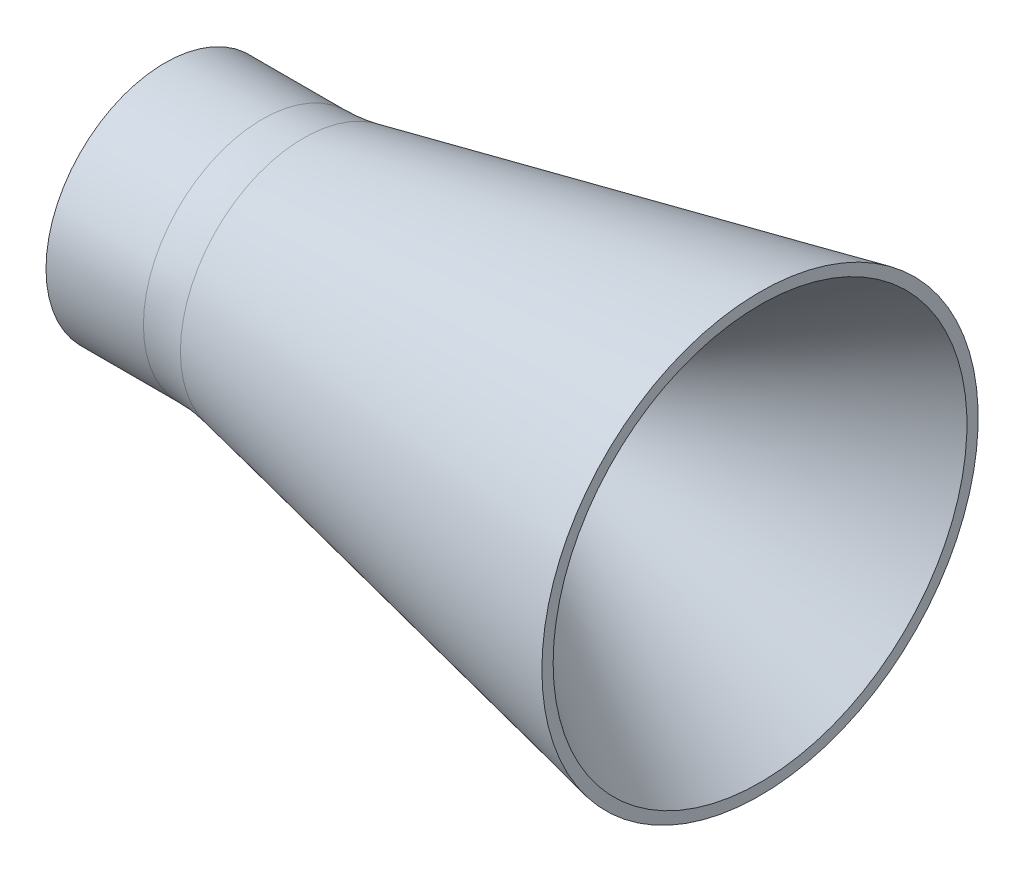
ISO-10303-21;
HEADER;
FILE_DESCRIPTION(('STEP AP214'),'2;1');
FILE_NAME('part.step','',(''),(''),'','','');
FILE_SCHEMA(('AUTOMOTIVE_DESIGN { 1 0 10303 214 1 1 1 1 }'));
ENDSEC;
DATA;
#1=APPLICATION_CONTEXT('core data for automotive mechanical design processes');
#2=APPLICATION_PROTOCOL_DEFINITION('international standard','automotive_design',2000,#1);
#3=PRODUCT_CONTEXT('',#1,'mechanical');
#4=PRODUCT('Part','Part','',(#3));
#5=PRODUCT_RELATED_PRODUCT_CATEGORY('part','',(#4));
#6=PRODUCT_DEFINITION_FORMATION('','',#4);
#7=PRODUCT_DEFINITION_CONTEXT('part definition',#1,'design');
#8=PRODUCT_DEFINITION('design','',#6,#7);
#9=PRODUCT_DEFINITION_SHAPE('','',#8);
#10=(LENGTH_UNIT() NAMED_UNIT(*) SI_UNIT(.MILLI.,.METRE.));
#11=(NAMED_UNIT(*) PLANE_ANGLE_UNIT() SI_UNIT($,.RADIAN.));
#12=(NAMED_UNIT(*) SI_UNIT($,.STERADIAN.) SOLID_ANGLE_UNIT());
#13=UNCERTAINTY_MEASURE_WITH_UNIT(LENGTH_MEASURE(1.E-05),#10,'distance_accuracy_value','');
#14=(GEOMETRIC_REPRESENTATION_CONTEXT(3) GLOBAL_UNCERTAINTY_ASSIGNED_CONTEXT((#13)) GLOBAL_UNIT_ASSIGNED_CONTEXT((#10,
#11,#12)) REPRESENTATION_CONTEXT('',''));
#15=CARTESIAN_POINT('',(0.,0.,0.));
#16=DIRECTION('',(0.,0.,1.));
#17=DIRECTION('',(1.,0.,0.));
#18=AXIS2_PLACEMENT_3D('',#15,#16,#17);
#19=CARTESIAN_POINT('',(110.081050811535,-13.5925231782912,0.));
#20=DIRECTION('',(-1.,0.,0.));
#21=DIRECTION('',(0.,0.,1.));
#22=AXIS2_PLACEMENT_3D('',#19,#20,#21);
#23=TOROIDAL_SURFACE('',#22,60.,40.);
#24=CARTESIAN_POINT('',(110.081050811535,-13.5925231782912,0.));
#25=DIRECTION('',(-1.,0.,0.));
#26=DIRECTION('',(0.,0.,1.));
#27=AXIS2_PLACEMENT_3D('',#24,#25,#26);
#28=CIRCLE('',#27,20.);
#29=CARTESIAN_POINT('',(110.081050811535,-13.5925231782912,20.));
#30=VERTEX_POINT('',#29);
#31=EDGE_CURVE('E10',#30,#30,#28,.T.);
#32=ORIENTED_EDGE('',*,*,#31,.F.);
#33=EDGE_LOOP('',(#32));
#34=FACE_BOUND('',#33,.T.);
#35=CARTESIAN_POINT('',(95.7463328297226,-13.5925231782912,0.));
#36=DIRECTION('',(-1.,0.,0.));
#37=DIRECTION('',(0.,0.,1.));
#38=AXIS2_PLACEMENT_3D('',#35,#36,#37);
#39=CIRCLE('',#38,22.6567829401119);
#40=CARTESIAN_POINT('',(95.7463328297226,-13.5925231782912,22.6567829401119));
#41=VERTEX_POINT('',#40);
#42=EDGE_CURVE('E73',#41,#41,#39,.T.);
#43=ORIENTED_EDGE('',*,*,#42,.T.);
#44=EDGE_LOOP('',(#43));
#45=FACE_BOUND('',#44,.T.);
#46=ADVANCED_FACE('F33',(#34,#45),#23,.T.);
#47=CARTESIAN_POINT('',(-9.07901843118839,-13.5925231782912,0.));
#48=DIRECTION('',(-1.,0.,0.));
#49=DIRECTION('',(0.,0.,1.));
#50=AXIS2_PLACEMENT_3D('',#47,#48,#49);
#51=CYLINDRICAL_SURFACE('',#50,20.);
#52=CARTESIAN_POINT('',(127.851823553188,-13.5925231782912,0.));
#53=DIRECTION('',(-1.,0.,0.));
#54=DIRECTION('',(0.,0.,1.));
#55=AXIS2_PLACEMENT_3D('',#52,#53,#54);
#56=CIRCLE('',#55,20.);
#57=CARTESIAN_POINT('',(127.851823553188,-13.5925231782912,20.));
#58=VERTEX_POINT('',#57);
#59=EDGE_CURVE('E39',#58,#58,#56,.T.);
#60=ORIENTED_EDGE('',*,*,#59,.F.);
#61=EDGE_LOOP('',(#60));
#62=FACE_BOUND('',#61,.T.);
#63=ORIENTED_EDGE('',*,*,#31,.T.);
#64=EDGE_LOOP('',(#63));
#65=FACE_BOUND('',#64,.T.);
#66=ADVANCED_FACE('F96',(#62,#65),#51,.F.);
#67=CARTESIAN_POINT('',(127.851823553188,-13.5925231782912,0.));
#68=DIRECTION('',(-1.,0.,0.));
#69=DIRECTION('',(0.,0.,1.));
#70=AXIS2_PLACEMENT_3D('',#67,#68,#69);
#71=TOROIDAL_SURFACE('',#70,60.,40.);
#72=CARTESIAN_POINT('',(150.219539692018,-13.5925231782912,0.));
#73=DIRECTION('',(-1.,0.,0.));
#74=DIRECTION('',(0.,0.,1.));
#75=AXIS2_PLACEMENT_3D('',#72,#73,#74);
#76=CIRCLE('',#75,26.8384970977984);
#77=CARTESIAN_POINT('',(150.219539692018,-13.5925231782912,26.8384970977984));
#78=VERTEX_POINT('',#77);
#79=EDGE_CURVE('E43',#78,#78,#76,.T.);
#80=ORIENTED_EDGE('',*,*,#79,.F.);
#81=EDGE_LOOP('',(#80));
#82=FACE_BOUND('',#81,.T.);
#83=ORIENTED_EDGE('',*,*,#59,.T.);
#84=EDGE_LOOP('',(#83));
#85=FACE_BOUND('',#84,.T.);
#86=ADVANCED_FACE('F101',(#82,#85),#71,.T.);
#87=CARTESIAN_POINT('',(150.219539692018,-13.5925231782912,0.));
#88=DIRECTION('',(1.,0.,0.));
#89=DIRECTION('',(0.,0.,-1.));
#90=AXIS2_PLACEMENT_3D('',#87,#88,#89);
#91=CONICAL_SURFACE('',#90,26.8384970977984,0.593411945678073);
#92=CARTESIAN_POINT('',(246.802204075876,-13.5925231782912,0.));
#93=DIRECTION('',(-1.,0.,0.));
#94=DIRECTION('',(0.,0.,1.));
#95=AXIS2_PLACEMENT_3D('',#92,#93,#94);
#96=CIRCLE('',#95,91.9843268040445);
#97=CARTESIAN_POINT('',(246.802204075876,-13.5925231782912,91.9843268040445));
#98=VERTEX_POINT('',#97);
#99=EDGE_CURVE('E47',#98,#98,#96,.T.);
#100=ORIENTED_EDGE('',*,*,#99,.F.);
#101=EDGE_LOOP('',(#100));
#102=FACE_BOUND('',#101,.T.);
#103=ORIENTED_EDGE('',*,*,#79,.T.);
#104=EDGE_LOOP('',(#103));
#105=FACE_BOUND('',#104,.T.);
#106=ADVANCED_FACE('F106',(#102,#105),#91,.F.);
#107=CARTESIAN_POINT('',(246.802204075876,78.3918036257533,0.));
#108=DIRECTION('',(-1.,0.,0.));
#109=DIRECTION('',(0.,0.,1.));
#110=AXIS2_PLACEMENT_3D('',#107,#108,#109);
#111=PLANE('',#110);
#112=CARTESIAN_POINT('',(246.802204075876,-13.5925231782912,0.));
#113=DIRECTION('',(-1.,0.,0.));
#114=DIRECTION('',(0.,0.,1.));
#115=AXIS2_PLACEMENT_3D('',#112,#113,#114);
#116=CIRCLE('',#115,96.9843268040445);
#117=CARTESIAN_POINT('',(246.802204075876,-13.5925231782912,96.9843268040445));
#118=VERTEX_POINT('',#117);
#119=EDGE_CURVE('E52',#118,#118,#116,.T.);
#120=ORIENTED_EDGE('',*,*,#119,.F.);
#121=EDGE_LOOP('',(#120));
#122=FACE_BOUND('',#121,.T.);
#123=ORIENTED_EDGE('',*,*,#99,.T.);
#124=EDGE_LOOP('',(#123));
#125=FACE_BOUND('',#124,.T.);
#126=ADVANCED_FACE('F112',(#122,#125),#111,.F.);
#127=CARTESIAN_POINT('',(43.876590916977,-13.5925231782912,0.));
#128=DIRECTION('',(1.,0.,0.));
#129=DIRECTION('',(0.,0.,-1.));
#130=AXIS2_PLACEMENT_3D('',#127,#128,#129);
#131=CONICAL_SURFACE('',#130,54.756462552543,0.205167236667844);
#132=ORIENTED_EDGE('',*,*,#119,.T.);
#133=EDGE_LOOP('',(#132));
#134=FACE_BOUND('',#133,.T.);
#135=CARTESIAN_POINT('',(43.876590916977,-13.5925231782912,0.));
#136=DIRECTION('',(-1.,0.,0.));
#137=DIRECTION('',(0.,0.,1.));
#138=AXIS2_PLACEMENT_3D('',#135,#136,#137);
#139=CIRCLE('',#138,54.756462552543);
#140=CARTESIAN_POINT('',(43.876590916977,-13.5925231782912,54.756462552543));
#141=VERTEX_POINT('',#140);
#142=EDGE_CURVE('E55',#141,#141,#139,.T.);
#143=ORIENTED_EDGE('',*,*,#142,.F.);
#144=EDGE_LOOP('',(#143));
#145=FACE_BOUND('',#144,.T.);
#146=ADVANCED_FACE('F116',(#134,#145),#131,.T.);
#147=CARTESIAN_POINT('',(25.5408106411181,-13.5925231782912,0.));
#148=DIRECTION('',(-1.,0.,0.));
#149=DIRECTION('',(0.,0.,1.));
#150=AXIS2_PLACEMENT_3D('',#147,#148,#149);
#151=TOROIDAL_SURFACE('',#150,142.868885976686,90.);
#152=CARTESIAN_POINT('',(25.5408106411181,-13.5925231782912,0.));
#153=DIRECTION('',(-1.,0.,0.));
#154=DIRECTION('',(0.,0.,1.));
#155=AXIS2_PLACEMENT_3D('',#152,#153,#154);
#156=CIRCLE('',#155,52.8688859766858);
#157=CARTESIAN_POINT('',(25.5408106411181,-13.5925231782912,52.8688859766858));
#158=VERTEX_POINT('',#157);
#159=EDGE_CURVE('E58',#158,#158,#156,.T.);
#160=ORIENTED_EDGE('',*,*,#159,.F.);
#161=EDGE_LOOP('',(#160));
#162=FACE_BOUND('',#161,.T.);
#163=ORIENTED_EDGE('',*,*,#142,.T.);
#164=EDGE_LOOP('',(#163));
#165=FACE_BOUND('',#164,.T.);
#166=ADVANCED_FACE('F120',(#162,#165),#151,.F.);
#167=CARTESIAN_POINT('',(-9.07901843118839,-13.5925231782912,0.));
#168=DIRECTION('',(-1.,0.,0.));
#169=DIRECTION('',(0.,0.,1.));
#170=AXIS2_PLACEMENT_3D('',#167,#168,#169);
#171=CYLINDRICAL_SURFACE('',#170,52.8688859766858);
#172=CARTESIAN_POINT('',(-17.7706069929533,-13.5925231782912,0.));
#173=DIRECTION('',(-1.,0.,0.));
#174=DIRECTION('',(0.,0.,1.));
#175=AXIS2_PLACEMENT_3D('',#172,#173,#174);
#176=CIRCLE('',#175,52.8688859766858);
#177=CARTESIAN_POINT('',(-17.7706069929533,-13.5925231782912,52.8688859766858));
#178=VERTEX_POINT('',#177);
#179=EDGE_CURVE('E61',#178,#178,#176,.T.);
#180=ORIENTED_EDGE('',*,*,#179,.F.);
#181=EDGE_LOOP('',(#180));
#182=FACE_BOUND('',#181,.T.);
#183=ORIENTED_EDGE('',*,*,#159,.T.);
#184=EDGE_LOOP('',(#183));
#185=FACE_BOUND('',#184,.T.);
#186=ADVANCED_FACE('F124',(#182,#185),#171,.T.);
#187=CARTESIAN_POINT('',(-17.7706069929533,34.2763627983946,0.));
#188=DIRECTION('',(-1.,0.,0.));
#189=DIRECTION('',(0.,0.,1.));
#190=AXIS2_PLACEMENT_3D('',#187,#188,#189);
#191=PLANE('',#190);
#192=ORIENTED_EDGE('',*,*,#179,.T.);
#193=EDGE_LOOP('',(#192));
#194=FACE_BOUND('',#193,.T.);
#195=CARTESIAN_POINT('',(-17.7706069929533,-13.5925231782912,0.));
#196=DIRECTION('',(-1.,0.,0.));
#197=DIRECTION('',(0.,0.,1.));
#198=AXIS2_PLACEMENT_3D('',#195,#196,#197);
#199=CIRCLE('',#198,47.8688859766858);
#200=CARTESIAN_POINT('',(-17.7706069929533,-13.5925231782912,47.8688859766858));
#201=VERTEX_POINT('',#200);
#202=EDGE_CURVE('E64',#201,#201,#199,.T.);
#203=ORIENTED_EDGE('',*,*,#202,.F.);
#204=EDGE_LOOP('',(#203));
#205=FACE_BOUND('',#204,.T.);
#206=ADVANCED_FACE('F92',(#194,#205),#191,.T.);
#207=CARTESIAN_POINT('',(-9.07901843118839,-13.5925231782912,0.));
#208=DIRECTION('',(-1.,0.,0.));
#209=DIRECTION('',(0.,0.,1.));
#210=AXIS2_PLACEMENT_3D('',#207,#208,#209);
#211=CYLINDRICAL_SURFACE('',#210,47.8688859766858);
#212=ORIENTED_EDGE('',*,*,#202,.T.);
#213=EDGE_LOOP('',(#212));
#214=FACE_BOUND('',#213,.T.);
#215=CARTESIAN_POINT('',(13.3860448673727,-13.5925231782912,0.));
#216=DIRECTION('',(-1.,0.,0.));
#217=DIRECTION('',(0.,0.,1.));
#218=AXIS2_PLACEMENT_3D('',#215,#216,#217);
#219=CIRCLE('',#218,47.8688859766858);
#220=CARTESIAN_POINT('',(13.3860448673727,-13.5925231782912,47.8688859766858));
#221=VERTEX_POINT('',#220);
#222=EDGE_CURVE('E67',#221,#221,#219,.T.);
#223=ORIENTED_EDGE('',*,*,#222,.F.);
#224=EDGE_LOOP('',(#223));
#225=FACE_BOUND('',#224,.T.);
#226=ADVANCED_FACE('F86',(#214,#225),#211,.F.);
#227=CARTESIAN_POINT('',(13.3860448673728,-13.5925231782912,0.));
#228=DIRECTION('',(-1.,0.,0.));
#229=DIRECTION('',(0.,0.,1.));
#230=AXIS2_PLACEMENT_3D('',#227,#228,#229);
#231=DEGENERATE_TOROIDAL_SURFACE('',#230,42.1311140233142,90.,.F.);
#232=ORIENTED_EDGE('',*,*,#222,.T.);
#233=EDGE_LOOP('',(#232));
#234=FACE_BOUND('',#233,.T.);
#235=CARTESIAN_POINT('',(45.6391603264498,-13.5925231782912,0.));
#236=DIRECTION('',(-1.,0.,0.));
#237=DIRECTION('',(0.,0.,1.));
#238=AXIS2_PLACEMENT_3D('',#235,#236,#237);
#239=CIRCLE('',#238,41.8911243614339);
#240=CARTESIAN_POINT('',(45.6391603264498,-13.5925231782912,41.8911243614339));
#241=VERTEX_POINT('',#240);
#242=EDGE_CURVE('E70',#241,#241,#239,.T.);
#243=ORIENTED_EDGE('',*,*,#242,.F.);
#244=EDGE_LOOP('',(#243));
#245=FACE_BOUND('',#244,.T.);
#246=ADVANCED_FACE('F81',(#234,#245),#231,.T.);
#247=CARTESIAN_POINT('',(45.6391603264498,-13.5925231782912,0.));
#248=DIRECTION('',(-1.,0.,0.));
#249=DIRECTION('',(0.,0.,1.));
#250=AXIS2_PLACEMENT_3D('',#247,#248,#249);
#251=CONICAL_SURFACE('',#250,41.8911243614339,0.36651914291881);
#252=ORIENTED_EDGE('',*,*,#42,.F.);
#253=EDGE_LOOP('',(#252));
#254=FACE_BOUND('',#253,.T.);
#255=ORIENTED_EDGE('',*,*,#242,.T.);
#256=EDGE_LOOP('',(#255));
#257=FACE_BOUND('',#256,.T.);
#258=ADVANCED_FACE('F78',(#254,#257),#251,.F.);
#259=CLOSED_SHELL('',(#46,#66,#86,#106,#126,#146,#166,#186,#206,#226,#246,#258));
#260=MANIFOLD_SOLID_BREP('B2',#259);
#261=ADVANCED_BREP_SHAPE_REPRESENTATION('',(#18,#260),#14);
#262=SHAPE_DEFINITION_REPRESENTATION(#9,#261);
ENDSEC;
END-ISO-10303-21;
